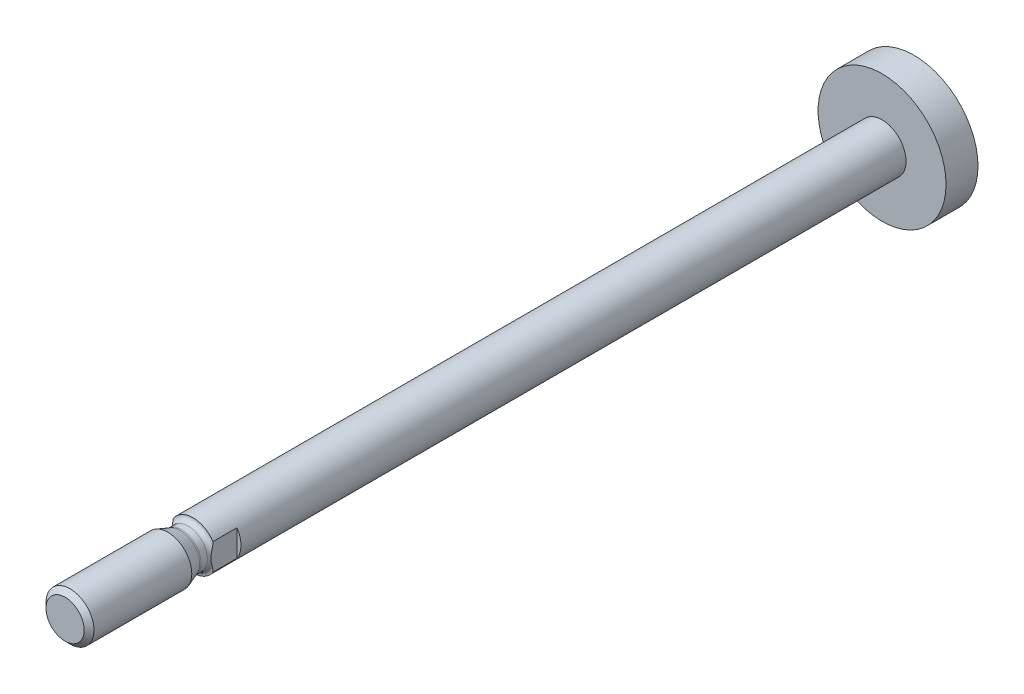
ISO-10303-21;
HEADER;
FILE_DESCRIPTION(('STEP AP214'),'2;1');
FILE_NAME('part.step','',(''),(''),'','','');
FILE_SCHEMA(('AUTOMOTIVE_DESIGN { 1 0 10303 214 1 1 1 1 }'));
ENDSEC;
DATA;
#1=APPLICATION_CONTEXT('core data for automotive mechanical design processes');
#2=APPLICATION_PROTOCOL_DEFINITION('international standard','automotive_design',2000,#1);
#3=PRODUCT_CONTEXT('',#1,'mechanical');
#4=PRODUCT('Part','Part','',(#3));
#5=PRODUCT_RELATED_PRODUCT_CATEGORY('part','',(#4));
#6=PRODUCT_DEFINITION_FORMATION('','',#4);
#7=PRODUCT_DEFINITION_CONTEXT('part definition',#1,'design');
#8=PRODUCT_DEFINITION('design','',#6,#7);
#9=PRODUCT_DEFINITION_SHAPE('','',#8);
#10=(LENGTH_UNIT() NAMED_UNIT(*) SI_UNIT(.MILLI.,.METRE.));
#11=(NAMED_UNIT(*) PLANE_ANGLE_UNIT() SI_UNIT($,.RADIAN.));
#12=(NAMED_UNIT(*) SI_UNIT($,.STERADIAN.) SOLID_ANGLE_UNIT());
#13=UNCERTAINTY_MEASURE_WITH_UNIT(LENGTH_MEASURE(1.E-05),#10,'distance_accuracy_value','');
#14=(GEOMETRIC_REPRESENTATION_CONTEXT(3) GLOBAL_UNCERTAINTY_ASSIGNED_CONTEXT((#13)) GLOBAL_UNIT_ASSIGNED_CONTEXT((#10,
#11,#12)) REPRESENTATION_CONTEXT('',''));
#15=CARTESIAN_POINT('',(0.,0.,0.));
#16=DIRECTION('',(0.,0.,1.));
#17=DIRECTION('',(1.,0.,0.));
#18=AXIS2_PLACEMENT_3D('',#15,#16,#17);
#19=CARTESIAN_POINT('',(0.,0.,-85.2));
#20=DIRECTION('',(0.,0.,1.));
#21=DIRECTION('',(1.,0.,0.));
#22=AXIS2_PLACEMENT_3D('',#19,#20,#21);
#23=CYLINDRICAL_SURFACE('',#22,3.);
#24=CARTESIAN_POINT('',(0.,0.,-81.2));
#25=DIRECTION('',(0.,0.,1.));
#26=DIRECTION('',(1.,0.,0.));
#27=AXIS2_PLACEMENT_3D('',#24,#25,#26);
#28=CIRCLE('',#27,3.);
#29=CARTESIAN_POINT('',(3.,0.,-81.2));
#30=VERTEX_POINT('',#29);
#31=EDGE_CURVE('E120',#30,#30,#28,.T.);
#32=ORIENTED_EDGE('',*,*,#31,.T.);
#33=EDGE_LOOP('',(#32));
#34=FACE_BOUND('',#33,.T.);
#35=DIRECTION('',(0.,0.,1.));
#36=VECTOR('',#35,1.);
#37=CARTESIAN_POINT('',(-2.5,-1.6583123951777,-85.2));
#38=LINE('',#37,#36);
#39=CARTESIAN_POINT('',(-2.5,-1.6583123951777,2.));
#40=VERTEX_POINT('',#39);
#41=CARTESIAN_POINT('',(-2.5,-1.6583123951777,5.));
#42=VERTEX_POINT('',#41);
#43=EDGE_CURVE('E50',#40,#42,#38,.T.);
#44=ORIENTED_EDGE('',*,*,#43,.F.);
#45=CARTESIAN_POINT('',(0.,0.,2.));
#46=DIRECTION('',(0.,0.,1.));
#47=DIRECTION('',(1.,0.,0.));
#48=AXIS2_PLACEMENT_3D('',#45,#46,#47);
#49=CIRCLE('',#48,3.);
#50=CARTESIAN_POINT('',(-2.5,1.6583123951777,2.));
#51=VERTEX_POINT('',#50);
#52=EDGE_CURVE('E11',#51,#40,#49,.T.);
#53=ORIENTED_EDGE('',*,*,#52,.F.);
#54=DIRECTION('',(0.,0.,1.));
#55=VECTOR('',#54,1.);
#56=CARTESIAN_POINT('',(-2.5,1.6583123951777,-85.2));
#57=LINE('',#56,#55);
#58=CARTESIAN_POINT('',(-2.5,1.65831239517778,4.99999999999909));
#59=VERTEX_POINT('',#58);
#60=EDGE_CURVE('E90',#59,#51,#57,.F.);
#61=ORIENTED_EDGE('',*,*,#60,.F.);
#62=CARTESIAN_POINT('',(0.,0.,5.));
#63=DIRECTION('',(0.,0.,1.));
#64=DIRECTION('',(1.,0.,0.));
#65=AXIS2_PLACEMENT_3D('',#62,#63,#64);
#66=CIRCLE('',#65,3.);
#67=CARTESIAN_POINT('',(2.5,1.6583123951777,5.));
#68=VERTEX_POINT('',#67);
#69=EDGE_CURVE('E89',#68,#59,#66,.T.);
#70=ORIENTED_EDGE('',*,*,#69,.F.);
#71=DIRECTION('',(0.,0.,1.));
#72=VECTOR('',#71,1.);
#73=CARTESIAN_POINT('',(2.5,1.6583123951777,-85.2));
#74=LINE('',#73,#72);
#75=CARTESIAN_POINT('',(2.5,1.6583123951777,2.));
#76=VERTEX_POINT('',#75);
#77=EDGE_CURVE('E58',#76,#68,#74,.T.);
#78=ORIENTED_EDGE('',*,*,#77,.F.);
#79=CARTESIAN_POINT('',(2.5,-1.6583123951777,2.));
#80=VERTEX_POINT('',#79);
#81=EDGE_CURVE('E39',#80,#76,#49,.T.);
#82=ORIENTED_EDGE('',*,*,#81,.F.);
#83=DIRECTION('',(0.,0.,1.));
#84=VECTOR('',#83,1.);
#85=CARTESIAN_POINT('',(2.5,-1.6583123951777,-85.2));
#86=LINE('',#85,#84);
#87=CARTESIAN_POINT('',(2.5,-1.65831239517778,4.99999999999909));
#88=VERTEX_POINT('',#87);
#89=EDGE_CURVE('E83',#88,#80,#86,.F.);
#90=ORIENTED_EDGE('',*,*,#89,.F.);
#91=EDGE_CURVE('E123',#42,#88,#66,.T.);
#92=ORIENTED_EDGE('',*,*,#91,.F.);
#93=EDGE_LOOP('',(#44,#53,#61,#70,#78,#82,#90,#92));
#94=FACE_BOUND('',#93,.T.);
#95=ADVANCED_FACE('F36',(#34,#94),#23,.T.);
#96=CARTESIAN_POINT('',(0.,0.,5.6000000000001));
#97=DIRECTION('',(0.,0.,1.));
#98=DIRECTION('',(1.,0.,0.));
#99=AXIS2_PLACEMENT_3D('',#96,#97,#98);
#100=TOROIDAL_SURFACE('',#99,3.0000000000001,0.600000000000099);
#101=CARTESIAN_POINT('',(0.,0.,5.6));
#102=DIRECTION('',(0.,0.,1.));
#103=DIRECTION('',(1.,0.,0.));
#104=AXIS2_PLACEMENT_3D('',#101,#102,#103);
#105=CIRCLE('',#104,2.4);
#106=CARTESIAN_POINT('',(2.4,0.,5.6));
#107=VERTEX_POINT('',#106);
#108=EDGE_CURVE('E111',#107,#107,#105,.T.);
#109=ORIENTED_EDGE('',*,*,#108,.F.);
#110=EDGE_LOOP('',(#109));
#111=FACE_BOUND('',#110,.T.);
#112=CARTESIAN_POINT('',(-2.5,0.,5.26833752096453));
#113=CARTESIAN_POINT('',(-2.5,0.0507234426297441,5.26834839993848));
#114=CARTESIAN_POINT('',(-2.5,0.101441776799662,5.26596843791489));
#115=CARTESIAN_POINT('',(-2.5,0.202536067556288,5.2569952015163));
#116=CARTESIAN_POINT('',(-2.5,0.252911588949165,5.2503973212644));
#117=CARTESIAN_POINT('',(-2.5,0.35392632203634,5.23403658213965));
#118=CARTESIAN_POINT('',(-2.5,0.404557369480025,5.224225913585));
#119=CARTESIAN_POINT('',(-2.5,0.505400398866161,5.20278595137819));
#120=CARTESIAN_POINT('',(-2.5,0.555612509775304,5.1911572409283));
#121=CARTESIAN_POINT('',(-2.5,0.655655613826413,5.16721678219831));
#122=CARTESIAN_POINT('',(-2.5,0.705487327239528,5.15490798008948));
#123=CARTESIAN_POINT('',(-2.5,0.805181864056362,5.13041893752706));
#124=CARTESIAN_POINT('',(-2.5,0.855044688832192,5.11823870324147));
#125=CARTESIAN_POINT('',(-2.5,1.00507376125951,5.08293674920261));
#126=CARTESIAN_POINT('',(-2.5,1.1055660279648,5.06108488117838));
#127=CARTESIAN_POINT('',(-2.5,1.30645493621981,5.02592717471424));
#128=CARTESIAN_POINT('',(-2.5,1.40682678389803,5.01248870030289));
#129=CARTESIAN_POINT('',(-2.5,1.60840199518987,4.99838763017595));
#130=CARTESIAN_POINT('',(-2.5,1.70960094347028,4.99767823287719));
#131=CARTESIAN_POINT('',(-2.5,1.86622781794818,5.01106448653587));
#132=CARTESIAN_POINT('',(-2.5,1.92218137883188,5.01877622049858));
#133=CARTESIAN_POINT('',(-2.5,2.03285053262341,5.0413651074687));
#134=CARTESIAN_POINT('',(-2.5,2.08756307823151,5.05625824117348));
#135=CARTESIAN_POINT('',(-2.5,2.18328084843635,5.09083457513036));
#136=CARTESIAN_POINT('',(-2.5,2.22483950461237,5.10896465354793));
#137=CARTESIAN_POINT('',(-2.5,2.30459524648064,5.1515245306446));
#138=CARTESIAN_POINT('',(-2.5,2.34279989724468,5.17593963670877));
#139=CARTESIAN_POINT('',(-2.5,2.40362753966407,5.22361594487622));
#140=CARTESIAN_POINT('',(-2.5,2.42757076392253,5.24518752529637));
#141=CARTESIAN_POINT('',(-2.5,2.47175757689057,5.29185573262645));
#142=CARTESIAN_POINT('',(-2.5,2.49200531158724,5.31694835263777));
#143=CARTESIAN_POINT('',(-2.5,2.52468492158815,5.36594738678137));
#144=CARTESIAN_POINT('',(-2.5,2.53785643218482,5.38935828111803));
#145=CARTESIAN_POINT('',(-2.5,2.56013164913301,5.43805384411947));
#146=CARTESIAN_POINT('',(-2.5,2.56923737677398,5.46333757440499));
#147=CARTESIAN_POINT('',(-2.5,2.58283057049981,5.51527496834575));
#148=CARTESIAN_POINT('',(-2.5,2.58729356105886,5.54193512227162));
#149=CARTESIAN_POINT('',(-2.5,2.59118020467599,5.59561989324821));
#150=CARTESIAN_POINT('',(-2.5,2.5906054179438,5.62264439487102));
#151=CARTESIAN_POINT('',(-2.5,2.5847447911938,5.67371298536964));
#152=CARTESIAN_POINT('',(-2.5,2.57988467167735,5.69780754958458));
#153=CARTESIAN_POINT('',(-2.5,2.56633022368149,5.74488485425705));
#154=CARTESIAN_POINT('',(-2.5,2.55763543991684,5.76786746233366));
#155=CARTESIAN_POINT('',(-2.5,2.53647695281551,5.81308697753744));
#156=CARTESIAN_POINT('',(-2.5,2.52388217742275,5.83526203314746));
#157=CARTESIAN_POINT('',(-2.5,2.49565831542702,5.87756858678122));
#158=CARTESIAN_POINT('',(-2.5,2.4800283022487,5.897699457906));
#159=CARTESIAN_POINT('',(-2.5,2.4381803160609,5.94494905141413));
#160=CARTESIAN_POINT('',(-2.5,2.41048793322772,5.97076525046522));
#161=CARTESIAN_POINT('',(-2.5,2.35128940318857,6.01762864695372));
#162=CARTESIAN_POINT('',(-2.5,2.31977194494069,6.03866114436212));
#163=CARTESIAN_POINT('',(-2.5,2.23952256294481,6.08463351159361));
#164=CARTESIAN_POINT('',(-2.5,2.18939204577726,6.10711912432076));
#165=CARTESIAN_POINT('',(-2.5,2.086424206848,6.14398267826286));
#166=CARTESIAN_POINT('',(-2.5,2.03358928965091,6.15836768991921));
#167=CARTESIAN_POINT('',(-2.5,1.93599580204544,6.17849484994285));
#168=CARTESIAN_POINT('',(-2.5,1.89144834077192,6.18531116329585));
#169=CARTESIAN_POINT('',(-2.5,1.80189908033616,6.19505697557448));
#170=CARTESIAN_POINT('',(-2.5,1.75689686177072,6.19798247787778));
#171=CARTESIAN_POINT('',(-2.5,1.66646832286127,6.20053377831371));
#172=CARTESIAN_POINT('',(-2.5,1.6210413945456,6.20013412759755));
#173=CARTESIAN_POINT('',(-2.5,1.53034280767568,6.19650595241103));
#174=CARTESIAN_POINT('',(-2.5,1.48507106445849,6.1932793543307));
#175=CARTESIAN_POINT('',(-2.5,1.33918047559004,6.17906735223514));
#176=CARTESIAN_POINT('',(-2.5,1.23902345631669,6.16342028964884));
#177=CARTESIAN_POINT('',(-2.5,1.03994836030368,6.12508984420092));
#178=CARTESIAN_POINT('',(-2.5,0.941034235224376,6.10238806221333));
#179=CARTESIAN_POINT('',(-2.5,0.793509038998567,6.06677672186832));
#180=CARTESIAN_POINT('',(-2.5,0.7446863854637,6.054702575567));
#181=CARTESIAN_POINT('',(-2.5,0.646996290398524,6.030738686552));
#182=CARTESIAN_POINT('',(-2.5,0.598128851070118,6.0188489352388));
#183=CARTESIAN_POINT('',(-2.5,0.500334281886721,5.99617397742217));
#184=CARTESIAN_POINT('',(-2.5,0.451408146263369,5.98538460255591));
#185=CARTESIAN_POINT('',(-2.5,0.353119090508098,5.96594052833405));
#186=CARTESIAN_POINT('',(-2.5,0.303756196305667,5.95728570312374));
#187=CARTESIAN_POINT('',(-2.5,0.204122497966492,5.94328110899502));
#188=CARTESIAN_POINT('',(-2.5,0.153847567097064,5.93795905985694));
#189=CARTESIAN_POINT('',(-2.5,0.0530351286873156,5.93177082830429));
#190=CARTESIAN_POINT('',(-2.5,0.0024977994589948,5.930901937583));
#191=CARTESIAN_POINT('',(-2.5,-0.0985305210715612,5.93381110626722));
#192=CARTESIAN_POINT('',(-2.5,-0.14902123482016,5.93759813511376));
#193=CARTESIAN_POINT('',(-2.5,-0.249573888409545,5.94904126176878));
#194=CARTESIAN_POINT('',(-2.5,-0.299635458091892,5.95670041313862));
#195=CARTESIAN_POINT('',(-2.5,-0.399725252919972,5.97472154484855));
#196=CARTESIAN_POINT('',(-2.5,-0.449748880216866,5.98510788708088));
#197=CARTESIAN_POINT('',(-2.5,-0.549453617514231,6.00732659888942));
#198=CARTESIAN_POINT('',(-2.5,-0.599134785603654,6.01915871651809));
#199=CARTESIAN_POINT('',(-2.5,-0.698392421521691,6.04328051823731));
#200=CARTESIAN_POINT('',(-2.5,-0.747968869022546,6.05557028383309));
#201=CARTESIAN_POINT('',(-2.5,-0.84720464589227,6.07981009984425));
#202=CARTESIAN_POINT('',(-2.5,-0.896863971124109,6.0917601667094));
#203=CARTESIAN_POINT('',(-2.5,-0.975241469303783,6.10978478042876));
#204=CARTESIAN_POINT('',(-2.5,-1.00388150216564,6.11619624816889));
#205=CARTESIAN_POINT('',(-2.5,-1.06125902675178,6.12857195456169));
#206=CARTESIAN_POINT('',(-2.5,-1.08999652018277,6.13453618533974));
#207=CARTESIAN_POINT('',(-2.5,-1.14748265723325,6.1458846074232));
#208=CARTESIAN_POINT('',(-2.5,-1.17623091126653,6.15127075206469));
#209=CARTESIAN_POINT('',(-2.5,-1.23384312688132,6.16137594760793));
#210=CARTESIAN_POINT('',(-2.5,-1.26270708577413,6.16609501391968));
#211=CARTESIAN_POINT('',(-2.5,-1.34949136584038,6.17908804539659));
#212=CARTESIAN_POINT('',(-2.5,-1.40759592627029,6.18619616796949));
#213=CARTESIAN_POINT('',(-2.5,-1.52420669712544,6.19636423685649));
#214=CARTESIAN_POINT('',(-2.5,-1.58271310503325,6.1994220245478));
#215=CARTESIAN_POINT('',(-2.5,-1.70911532678372,6.20051114496721));
#216=CARTESIAN_POINT('',(-2.5,-1.77702602049488,6.19766666103081));
#217=CARTESIAN_POINT('',(-2.5,-1.912149147007,6.18315262249392));
#218=CARTESIAN_POINT('',(-2.5,-1.97936016975703,6.17146782027944));
#219=CARTESIAN_POINT('',(-2.5,-2.09293467910467,6.14162835403314));
#220=CARTESIAN_POINT('',(-2.5,-2.1399801193776,6.12611102431254));
#221=CARTESIAN_POINT('',(-2.5,-2.23116163556241,6.08815370009842));
#222=CARTESIAN_POINT('',(-2.5,-2.27530548479003,6.06573319994486));
#223=CARTESIAN_POINT('',(-2.5,-2.34660579555824,6.0206656653127));
#224=CARTESIAN_POINT('',(-2.5,-2.37498330055351,5.99995880382842));
#225=CARTESIAN_POINT('',(-2.5,-2.42818185419372,5.95435228802646));
#226=CARTESIAN_POINT('',(-2.5,-2.45300628498281,5.92945667074117));
#227=CARTESIAN_POINT('',(-2.5,-2.49337206402375,5.88080957286876));
#228=CARTESIAN_POINT('',(-2.5,-2.50977972671913,5.85778028891266));
#229=CARTESIAN_POINT('',(-2.5,-2.5385948801776,5.80932543735906));
#230=CARTESIAN_POINT('',(-2.5,-2.55100468980703,5.7839012699618));
#231=CARTESIAN_POINT('',(-2.5,-2.57111606880391,5.7310152189761));
#232=CARTESIAN_POINT('',(-2.5,-2.57878240755407,5.70353974708557));
#233=CARTESIAN_POINT('',(-2.5,-2.58865812747843,5.64762323062993));
#234=CARTESIAN_POINT('',(-2.5,-2.59087093912576,5.61918280447873));
#235=CARTESIAN_POINT('',(-2.5,-2.58974032110845,5.56589468768046));
#236=CARTESIAN_POINT('',(-2.5,-2.58704036062141,5.54103102121321));
#237=CARTESIAN_POINT('',(-2.5,-2.57748265423562,5.49212434637714));
#238=CARTESIAN_POINT('',(-2.5,-2.57062518368025,5.46808128377277));
#239=CARTESIAN_POINT('',(-2.5,-2.55318309970271,5.42147694109437));
#240=CARTESIAN_POINT('',(-2.5,-2.54260847384664,5.39891188066154));
#241=CARTESIAN_POINT('',(-2.5,-2.51826231502416,5.35558968714916));
#242=CARTESIAN_POINT('',(-2.5,-2.50448933519591,5.33483337816906));
#243=CARTESIAN_POINT('',(-2.5,-2.46797257111134,5.28708275256527));
#244=CARTESIAN_POINT('',(-2.5,-2.44388663659998,5.26111270404154));
#245=CARTESIAN_POINT('',(-2.5,-2.39183121173732,5.21341702762138));
#246=CARTESIAN_POINT('',(-2.5,-2.36385414462067,5.19169988455002));
#247=CARTESIAN_POINT('',(-2.5,-2.29309604385226,5.14424955817408));
#248=CARTESIAN_POINT('',(-2.5,-2.24896151787955,5.12054273771195));
#249=CARTESIAN_POINT('',(-2.5,-2.15755724893995,5.08032986787273));
#250=CARTESIAN_POINT('',(-2.5,-2.1102815253453,5.0638380357592));
#251=CARTESIAN_POINT('',(-2.5,-1.98539576167196,5.02901994971649));
#252=CARTESIAN_POINT('',(-2.5,-1.90647682078743,5.01544295171964));
#253=CARTESIAN_POINT('',(-2.5,-1.74768813149434,5.00017484346382));
#254=CARTESIAN_POINT('',(-2.5,-1.66781762927049,4.99849388464395));
#255=CARTESIAN_POINT('',(-2.5,-1.45429321635247,5.00579419289827));
#256=CARTESIAN_POINT('',(-2.5,-1.32097329964418,5.02279704607492));
#257=CARTESIAN_POINT('',(-2.5,-1.12273292987174,5.05843900515103));
#258=CARTESIAN_POINT('',(-2.5,-1.05669317759064,5.07208123732001));
#259=CARTESIAN_POINT('',(-2.5,-0.925080173294097,5.10144856377507));
#260=CARTESIAN_POINT('',(-2.5,-0.85950678696237,5.11717303045709));
#261=CARTESIAN_POINT('',(-2.5,-0.728157455724953,5.14928145287764));
#262=CARTESIAN_POINT('',(-2.5,-0.662382356378558,5.16566853749943));
#263=CARTESIAN_POINT('',(-2.5,-0.530451230737349,5.19710748690057));
#264=CARTESIAN_POINT('',(-2.5,-0.46429498692756,5.21215848739435));
#265=CARTESIAN_POINT('',(-2.5,-0.332137198799993,5.23811298682939));
#266=CARTESIAN_POINT('',(-2.5,-0.266147995614798,5.24907485812429));
#267=CARTESIAN_POINT('',(-2.5,-0.13343508853748,5.26417313941374));
#268=CARTESIAN_POINT('',(-2.5,-0.0667131258677896,5.26832321258322));
#269=CARTESIAN_POINT('',(-2.5,0.,5.26833752096453));
#270=B_SPLINE_CURVE_WITH_KNOTS('',3,(#112,#113,#114,#115,#116,#117,#118,#119,#120,#121,#122,
#123,#124,#125,#126,#127,#128,#129,#130,#131,#132,#133,#134,#135,#136,#137,#138,#139,#140,#141,
#142,#143,#144,#145,#146,#147,#148,#149,#150,#151,#152,#153,#154,#155,#156,#157,#158,#159,#160,
#161,#162,#163,#164,#165,#166,#167,#168,#169,#170,#171,#172,#173,#174,#175,#176,#177,#178,#179,
#180,#181,#182,#183,#184,#185,#186,#187,#188,#189,#190,#191,#192,#193,#194,#195,#196,#197,#198,
#199,#200,#201,#202,#203,#204,#205,#206,#207,#208,#209,#210,#211,#212,#213,#214,#215,#216,#217,
#218,#219,#220,#221,#222,#223,#224,#225,#226,#227,#228,#229,#230,#231,#232,#233,#234,#235,#236,
#237,#238,#239,#240,#241,#242,#243,#244,#245,#246,#247,#248,#249,#250,#251,#252,#253,#254,#255,
#256,#257,#258,#259,#260,#261,#262,#263,#264,#265,#266,#267,#268,#269),.UNSPECIFIED.,.T.,.F.,(4,
2,2,2,2,2,2,2,2,2,2,2,2,2,2,2,2,2,2,2,2,2,2,2,2,2,2,2,2,2,2,2,2,2,2,2,2,2,2,2,2,2,2,2,2,2,2,2,2,
2,2,2,2,2,2,2,2,2,2,2,2,2,2,2,2,2,2,2,2,2,2,2,2,2,2,2,2,2,4),(0.,0.152115749462961,
0.304397890479205,0.459057777660119,0.613668153537359,0.76765452052503,0.921648241698668,
1.22999186740174,1.53334327295527,1.83557910296654,2.00468122496769,2.17416139710525,
2.30975526259906,2.44503498191611,2.54138706790922,2.63763038250484,2.71788414225495,
2.79809795959123,2.87873253660465,2.95934214181033,3.03274594433316,3.10615846435156,
3.18237030946167,3.25860545664829,3.37154774885102,3.48483255287211,3.64874326809032,
3.81251069461259,3.94751849926572,4.08266487644991,4.21884653384819,4.35493546397263,
4.65852821936571,4.96291950372185,5.11380283698696,5.2646791123006,5.41496078164642,
5.56523358814694,5.71674021710462,5.86815469233289,6.01986131905259,6.17168776888823,
6.3249195654772,6.47812469716163,6.63135724578266,6.7845823615018,6.87262624262423,
6.9606716735928,7.04840955727845,7.13614541382411,7.31164210225534,7.487232283928,
7.69072100095721,7.89456149389004,8.04275027379228,8.1905243529531,8.29556794817655,
8.40051087855684,8.48500651711341,8.56945305722983,8.65451949621374,8.73953241154295,
8.81419843639983,8.88885951681877,8.96332150589878,9.03781724571823,9.14348655987521,
9.24936459025057,9.39882327642183,9.54857516145059,9.78744806917548,10.0265247936209,
10.4280628477144,10.630387719692,10.8326517473681,11.0360188284461,11.239516519211,
11.439986712254,11.6400543065313),.UNSPECIFIED.);
#271=EDGE_CURVE('E81',#42,#59,#270,.T.);
#272=ORIENTED_EDGE('',*,*,#271,.F.);
#273=ORIENTED_EDGE('',*,*,#91,.T.);
#274=CARTESIAN_POINT('',(2.5,0.,5.26833752096453));
#275=CARTESIAN_POINT('',(2.5,-0.0507234426297441,5.26834839993848));
#276=CARTESIAN_POINT('',(2.5,-0.101441776799662,5.26596843791489));
#277=CARTESIAN_POINT('',(2.5,-0.202536067556288,5.2569952015163));
#278=CARTESIAN_POINT('',(2.5,-0.252911588949165,5.2503973212644));
#279=CARTESIAN_POINT('',(2.5,-0.35392632203634,5.23403658213965));
#280=CARTESIAN_POINT('',(2.5,-0.404557369480025,5.224225913585));
#281=CARTESIAN_POINT('',(2.5,-0.505400398866161,5.20278595137819));
#282=CARTESIAN_POINT('',(2.5,-0.555612509775304,5.1911572409283));
#283=CARTESIAN_POINT('',(2.5,-0.655655613826413,5.16721678219831));
#284=CARTESIAN_POINT('',(2.5,-0.705487327239528,5.15490798008948));
#285=CARTESIAN_POINT('',(2.5,-0.805181864056362,5.13041893752706));
#286=CARTESIAN_POINT('',(2.5,-0.855044688832192,5.11823870324147));
#287=CARTESIAN_POINT('',(2.5,-1.00507376125951,5.08293674920261));
#288=CARTESIAN_POINT('',(2.5,-1.1055660279648,5.06108488117838));
#289=CARTESIAN_POINT('',(2.5,-1.30645493621981,5.02592717471424));
#290=CARTESIAN_POINT('',(2.5,-1.40682678389803,5.01248870030289));
#291=CARTESIAN_POINT('',(2.5,-1.60840199518987,4.99838763017595));
#292=CARTESIAN_POINT('',(2.5,-1.70960094347028,4.99767823287719));
#293=CARTESIAN_POINT('',(2.5,-1.86622781794818,5.01106448653587));
#294=CARTESIAN_POINT('',(2.5,-1.92218137883188,5.01877622049858));
#295=CARTESIAN_POINT('',(2.5,-2.03285053262341,5.0413651074687));
#296=CARTESIAN_POINT('',(2.5,-2.08756307823151,5.05625824117348));
#297=CARTESIAN_POINT('',(2.5,-2.18328084843635,5.09083457513036));
#298=CARTESIAN_POINT('',(2.5,-2.22483950461237,5.10896465354793));
#299=CARTESIAN_POINT('',(2.5,-2.30459524648064,5.1515245306446));
#300=CARTESIAN_POINT('',(2.5,-2.34279989724468,5.17593963670877));
#301=CARTESIAN_POINT('',(2.5,-2.40362753966407,5.22361594487622));
#302=CARTESIAN_POINT('',(2.5,-2.42757076392253,5.24518752529637));
#303=CARTESIAN_POINT('',(2.5,-2.47175757689057,5.29185573262645));
#304=CARTESIAN_POINT('',(2.5,-2.49200531158724,5.31694835263777));
#305=CARTESIAN_POINT('',(2.5,-2.52468492158815,5.36594738678137));
#306=CARTESIAN_POINT('',(2.5,-2.53785643218482,5.38935828111803));
#307=CARTESIAN_POINT('',(2.5,-2.56013164913301,5.43805384411947));
#308=CARTESIAN_POINT('',(2.5,-2.56923737677398,5.46333757440499));
#309=CARTESIAN_POINT('',(2.5,-2.58283057049981,5.51527496834575));
#310=CARTESIAN_POINT('',(2.5,-2.58729356105886,5.54193512227162));
#311=CARTESIAN_POINT('',(2.5,-2.59118020467599,5.59561989324821));
#312=CARTESIAN_POINT('',(2.5,-2.5906054179438,5.62264439487102));
#313=CARTESIAN_POINT('',(2.5,-2.5847447911938,5.67371298536964));
#314=CARTESIAN_POINT('',(2.5,-2.57988467167735,5.69780754958458));
#315=CARTESIAN_POINT('',(2.5,-2.56633022368149,5.74488485425705));
#316=CARTESIAN_POINT('',(2.5,-2.55763543991684,5.76786746233366));
#317=CARTESIAN_POINT('',(2.5,-2.53647695281551,5.81308697753744));
#318=CARTESIAN_POINT('',(2.5,-2.52388217742275,5.83526203314746));
#319=CARTESIAN_POINT('',(2.5,-2.49565831542702,5.87756858678122));
#320=CARTESIAN_POINT('',(2.5,-2.4800283022487,5.897699457906));
#321=CARTESIAN_POINT('',(2.5,-2.4381803160609,5.94494905141413));
#322=CARTESIAN_POINT('',(2.5,-2.41048793322772,5.97076525046522));
#323=CARTESIAN_POINT('',(2.5,-2.35128940318857,6.01762864695372));
#324=CARTESIAN_POINT('',(2.5,-2.31977194494069,6.03866114436212));
#325=CARTESIAN_POINT('',(2.5,-2.23952256294481,6.08463351159361));
#326=CARTESIAN_POINT('',(2.5,-2.18939204577726,6.10711912432076));
#327=CARTESIAN_POINT('',(2.5,-2.086424206848,6.14398267826286));
#328=CARTESIAN_POINT('',(2.5,-2.03358928965091,6.15836768991921));
#329=CARTESIAN_POINT('',(2.5,-1.93599580204544,6.17849484994285));
#330=CARTESIAN_POINT('',(2.5,-1.89144834077192,6.18531116329585));
#331=CARTESIAN_POINT('',(2.5,-1.80189908033616,6.19505697557448));
#332=CARTESIAN_POINT('',(2.5,-1.75689686177072,6.19798247787778));
#333=CARTESIAN_POINT('',(2.5,-1.66646832286127,6.20053377831371));
#334=CARTESIAN_POINT('',(2.5,-1.6210413945456,6.20013412759755));
#335=CARTESIAN_POINT('',(2.5,-1.53034280767568,6.19650595241103));
#336=CARTESIAN_POINT('',(2.5,-1.48507106445849,6.1932793543307));
#337=CARTESIAN_POINT('',(2.5,-1.33918047559004,6.17906735223514));
#338=CARTESIAN_POINT('',(2.5,-1.23902345631669,6.16342028964884));
#339=CARTESIAN_POINT('',(2.5,-1.03994836030368,6.12508984420092));
#340=CARTESIAN_POINT('',(2.5,-0.941034235224376,6.10238806221333));
#341=CARTESIAN_POINT('',(2.5,-0.793509038998567,6.06677672186832));
#342=CARTESIAN_POINT('',(2.5,-0.7446863854637,6.054702575567));
#343=CARTESIAN_POINT('',(2.5,-0.646996290398524,6.030738686552));
#344=CARTESIAN_POINT('',(2.5,-0.598128851070118,6.0188489352388));
#345=CARTESIAN_POINT('',(2.5,-0.500334281886721,5.99617397742217));
#346=CARTESIAN_POINT('',(2.5,-0.451408146263369,5.98538460255591));
#347=CARTESIAN_POINT('',(2.5,-0.353119090508098,5.96594052833405));
#348=CARTESIAN_POINT('',(2.5,-0.303756196305667,5.95728570312374));
#349=CARTESIAN_POINT('',(2.5,-0.204122497966492,5.94328110899502));
#350=CARTESIAN_POINT('',(2.5,-0.153847567097064,5.93795905985694));
#351=CARTESIAN_POINT('',(2.5,-0.0530351286873156,5.93177082830429));
#352=CARTESIAN_POINT('',(2.5,-0.0024977994589948,5.930901937583));
#353=CARTESIAN_POINT('',(2.5,0.0985305210715612,5.93381110626722));
#354=CARTESIAN_POINT('',(2.5,0.14902123482016,5.93759813511376));
#355=CARTESIAN_POINT('',(2.5,0.249573888409545,5.94904126176878));
#356=CARTESIAN_POINT('',(2.5,0.299635458091892,5.95670041313862));
#357=CARTESIAN_POINT('',(2.5,0.399725252919972,5.97472154484855));
#358=CARTESIAN_POINT('',(2.5,0.449748880216866,5.98510788708088));
#359=CARTESIAN_POINT('',(2.5,0.549453617514231,6.00732659888942));
#360=CARTESIAN_POINT('',(2.5,0.599134785603654,6.01915871651809));
#361=CARTESIAN_POINT('',(2.5,0.698392421521691,6.04328051823731));
#362=CARTESIAN_POINT('',(2.5,0.747968869022546,6.05557028383309));
#363=CARTESIAN_POINT('',(2.5,0.84720464589227,6.07981009984425));
#364=CARTESIAN_POINT('',(2.5,0.896863971124109,6.0917601667094));
#365=CARTESIAN_POINT('',(2.5,0.975241469303783,6.10978478042876));
#366=CARTESIAN_POINT('',(2.5,1.00388150216564,6.11619624816889));
#367=CARTESIAN_POINT('',(2.5,1.06125902675178,6.12857195456169));
#368=CARTESIAN_POINT('',(2.5,1.08999652018277,6.13453618533974));
#369=CARTESIAN_POINT('',(2.5,1.14748265723325,6.1458846074232));
#370=CARTESIAN_POINT('',(2.5,1.17623091126653,6.15127075206469));
#371=CARTESIAN_POINT('',(2.5,1.23384312688132,6.16137594760793));
#372=CARTESIAN_POINT('',(2.5,1.26270708577413,6.16609501391968));
#373=CARTESIAN_POINT('',(2.5,1.34949136584038,6.17908804539659));
#374=CARTESIAN_POINT('',(2.5,1.40759592627029,6.18619616796949));
#375=CARTESIAN_POINT('',(2.5,1.52420669712544,6.19636423685649));
#376=CARTESIAN_POINT('',(2.5,1.58271310503325,6.1994220245478));
#377=CARTESIAN_POINT('',(2.5,1.70911532678372,6.20051114496721));
#378=CARTESIAN_POINT('',(2.5,1.77702602049488,6.19766666103081));
#379=CARTESIAN_POINT('',(2.5,1.912149147007,6.18315262249392));
#380=CARTESIAN_POINT('',(2.5,1.97936016975703,6.17146782027944));
#381=CARTESIAN_POINT('',(2.5,2.09293467910467,6.14162835403314));
#382=CARTESIAN_POINT('',(2.5,2.1399801193776,6.12611102431254));
#383=CARTESIAN_POINT('',(2.5,2.23116163556241,6.08815370009842));
#384=CARTESIAN_POINT('',(2.5,2.27530548479003,6.06573319994486));
#385=CARTESIAN_POINT('',(2.5,2.34660579555824,6.0206656653127));
#386=CARTESIAN_POINT('',(2.5,2.37498330055351,5.99995880382842));
#387=CARTESIAN_POINT('',(2.5,2.42818185419372,5.95435228802646));
#388=CARTESIAN_POINT('',(2.5,2.45300628498281,5.92945667074117));
#389=CARTESIAN_POINT('',(2.5,2.49337206402375,5.88080957286876));
#390=CARTESIAN_POINT('',(2.5,2.50977972671913,5.85778028891266));
#391=CARTESIAN_POINT('',(2.5,2.5385948801776,5.80932543735906));
#392=CARTESIAN_POINT('',(2.5,2.55100468980703,5.7839012699618));
#393=CARTESIAN_POINT('',(2.5,2.57111606880391,5.7310152189761));
#394=CARTESIAN_POINT('',(2.5,2.57878240755407,5.70353974708557));
#395=CARTESIAN_POINT('',(2.5,2.58865812747843,5.64762323062993));
#396=CARTESIAN_POINT('',(2.5,2.59087093912576,5.61918280447873));
#397=CARTESIAN_POINT('',(2.5,2.58974032110845,5.56589468768046));
#398=CARTESIAN_POINT('',(2.5,2.58704036062141,5.54103102121321));
#399=CARTESIAN_POINT('',(2.5,2.57748265423562,5.49212434637714));
#400=CARTESIAN_POINT('',(2.5,2.57062518368025,5.46808128377277));
#401=CARTESIAN_POINT('',(2.5,2.55318309970271,5.42147694109437));
#402=CARTESIAN_POINT('',(2.5,2.54260847384664,5.39891188066154));
#403=CARTESIAN_POINT('',(2.5,2.51826231502416,5.35558968714916));
#404=CARTESIAN_POINT('',(2.5,2.50448933519591,5.33483337816906));
#405=CARTESIAN_POINT('',(2.5,2.46797257111134,5.28708275256527));
#406=CARTESIAN_POINT('',(2.5,2.44388663659998,5.26111270404154));
#407=CARTESIAN_POINT('',(2.5,2.39183121173732,5.21341702762138));
#408=CARTESIAN_POINT('',(2.5,2.36385414462067,5.19169988455002));
#409=CARTESIAN_POINT('',(2.5,2.29309604385226,5.14424955817408));
#410=CARTESIAN_POINT('',(2.5,2.24896151787955,5.12054273771195));
#411=CARTESIAN_POINT('',(2.5,2.15755724893995,5.08032986787273));
#412=CARTESIAN_POINT('',(2.5,2.1102815253453,5.0638380357592));
#413=CARTESIAN_POINT('',(2.5,1.98539576167196,5.02901994971649));
#414=CARTESIAN_POINT('',(2.5,1.90647682078743,5.01544295171964));
#415=CARTESIAN_POINT('',(2.5,1.74768813149434,5.00017484346382));
#416=CARTESIAN_POINT('',(2.5,1.66781762927049,4.99849388464395));
#417=CARTESIAN_POINT('',(2.5,1.45429321635247,5.00579419289827));
#418=CARTESIAN_POINT('',(2.5,1.32097329964418,5.02279704607492));
#419=CARTESIAN_POINT('',(2.5,1.12273292987174,5.05843900515103));
#420=CARTESIAN_POINT('',(2.5,1.05669317759064,5.07208123732001));
#421=CARTESIAN_POINT('',(2.5,0.925080173294097,5.10144856377507));
#422=CARTESIAN_POINT('',(2.5,0.85950678696237,5.11717303045709));
#423=CARTESIAN_POINT('',(2.5,0.728157455724953,5.14928145287764));
#424=CARTESIAN_POINT('',(2.5,0.662382356378558,5.16566853749943));
#425=CARTESIAN_POINT('',(2.5,0.530451230737349,5.19710748690057));
#426=CARTESIAN_POINT('',(2.5,0.46429498692756,5.21215848739435));
#427=CARTESIAN_POINT('',(2.5,0.332137198799993,5.23811298682939));
#428=CARTESIAN_POINT('',(2.5,0.266147995614798,5.24907485812429));
#429=CARTESIAN_POINT('',(2.5,0.13343508853748,5.26417313941374));
#430=CARTESIAN_POINT('',(2.5,0.0667131258677896,5.26832321258322));
#431=CARTESIAN_POINT('',(2.5,0.,5.26833752096453));
#432=B_SPLINE_CURVE_WITH_KNOTS('',3,(#274,#275,#276,#277,#278,#279,#280,#281,#282,#283,#284,
#285,#286,#287,#288,#289,#290,#291,#292,#293,#294,#295,#296,#297,#298,#299,#300,#301,#302,#303,
#304,#305,#306,#307,#308,#309,#310,#311,#312,#313,#314,#315,#316,#317,#318,#319,#320,#321,#322,
#323,#324,#325,#326,#327,#328,#329,#330,#331,#332,#333,#334,#335,#336,#337,#338,#339,#340,#341,
#342,#343,#344,#345,#346,#347,#348,#349,#350,#351,#352,#353,#354,#355,#356,#357,#358,#359,#360,
#361,#362,#363,#364,#365,#366,#367,#368,#369,#370,#371,#372,#373,#374,#375,#376,#377,#378,#379,
#380,#381,#382,#383,#384,#385,#386,#387,#388,#389,#390,#391,#392,#393,#394,#395,#396,#397,#398,
#399,#400,#401,#402,#403,#404,#405,#406,#407,#408,#409,#410,#411,#412,#413,#414,#415,#416,#417,
#418,#419,#420,#421,#422,#423,#424,#425,#426,#427,#428,#429,#430,#431),.UNSPECIFIED.,.T.,.F.,(4,
2,2,2,2,2,2,2,2,2,2,2,2,2,2,2,2,2,2,2,2,2,2,2,2,2,2,2,2,2,2,2,2,2,2,2,2,2,2,2,2,2,2,2,2,2,2,2,2,
2,2,2,2,2,2,2,2,2,2,2,2,2,2,2,2,2,2,2,2,2,2,2,2,2,2,2,2,2,4),(0.,0.152115749462961,
0.304397890479205,0.459057777660119,0.613668153537359,0.76765452052503,0.921648241698668,
1.22999186740174,1.53334327295527,1.83557910296654,2.00468122496769,2.17416139710525,
2.30975526259906,2.44503498191611,2.54138706790922,2.63763038250484,2.71788414225495,
2.79809795959123,2.87873253660465,2.95934214181033,3.03274594433316,3.10615846435156,
3.18237030946167,3.25860545664829,3.37154774885102,3.48483255287211,3.64874326809032,
3.81251069461259,3.94751849926572,4.08266487644991,4.21884653384819,4.35493546397263,
4.65852821936571,4.96291950372185,5.11380283698696,5.2646791123006,5.41496078164642,
5.56523358814694,5.71674021710462,5.86815469233289,6.01986131905259,6.17168776888823,
6.3249195654772,6.47812469716163,6.63135724578266,6.7845823615018,6.87262624262423,
6.9606716735928,7.04840955727845,7.13614541382411,7.31164210225534,7.487232283928,
7.69072100095721,7.89456149389004,8.04275027379228,8.1905243529531,8.29556794817655,
8.40051087855684,8.48500651711341,8.56945305722983,8.65451949621374,8.73953241154295,
8.81419843639983,8.88885951681877,8.96332150589878,9.03781724571823,9.14348655987521,
9.24936459025057,9.39882327642183,9.54857516145059,9.78744806917548,10.0265247936209,
10.4280628477144,10.630387719692,10.8326517473681,11.0360188284461,11.239516519211,
11.439986712254,11.6400543065313),.UNSPECIFIED.);
#433=EDGE_CURVE('E125',#68,#88,#432,.T.);
#434=ORIENTED_EDGE('',*,*,#433,.F.);
#435=ORIENTED_EDGE('',*,*,#69,.T.);
#436=EDGE_LOOP('',(#272,#273,#434,#435));
#437=FACE_BOUND('',#436,.T.);
#438=ADVANCED_FACE('F135',(#111,#437),#100,.F.);
#439=CARTESIAN_POINT('',(0.,3.,-81.2));
#440=DIRECTION('',(0.,0.,-1.));
#441=DIRECTION('',(-1.,0.,0.));
#442=AXIS2_PLACEMENT_3D('',#439,#440,#441);
#443=PLANE('',#442);
#444=ORIENTED_EDGE('',*,*,#31,.F.);
#445=EDGE_LOOP('',(#444));
#446=FACE_BOUND('',#445,.T.);
#447=CARTESIAN_POINT('',(0.,0.,-81.2));
#448=DIRECTION('',(0.,0.,1.));
#449=DIRECTION('',(1.,0.,0.));
#450=AXIS2_PLACEMENT_3D('',#447,#448,#449);
#451=CIRCLE('',#450,8.);
#452=CARTESIAN_POINT('',(8.,0.,-81.2));
#453=VERTEX_POINT('',#452);
#454=EDGE_CURVE('E117',#453,#453,#451,.T.);
#455=ORIENTED_EDGE('',*,*,#454,.T.);
#456=EDGE_LOOP('',(#455));
#457=FACE_BOUND('',#456,.T.);
#458=ADVANCED_FACE('F182',(#446,#457),#443,.F.);
#459=CARTESIAN_POINT('',(0.,0.,-85.2));
#460=DIRECTION('',(0.,0.,1.));
#461=DIRECTION('',(1.,0.,0.));
#462=AXIS2_PLACEMENT_3D('',#459,#460,#461);
#463=CYLINDRICAL_SURFACE('',#462,8.);
#464=ORIENTED_EDGE('',*,*,#454,.F.);
#465=EDGE_LOOP('',(#464));
#466=FACE_BOUND('',#465,.T.);
#467=CARTESIAN_POINT('',(0.,0.,-85.2));
#468=DIRECTION('',(0.,0.,1.));
#469=DIRECTION('',(1.,0.,0.));
#470=AXIS2_PLACEMENT_3D('',#467,#468,#469);
#471=CIRCLE('',#470,8.);
#472=CARTESIAN_POINT('',(8.,0.,-85.2));
#473=VERTEX_POINT('',#472);
#474=EDGE_CURVE('E114',#473,#473,#471,.T.);
#475=ORIENTED_EDGE('',*,*,#474,.T.);
#476=EDGE_LOOP('',(#475));
#477=FACE_BOUND('',#476,.T.);
#478=ADVANCED_FACE('F173',(#466,#477),#463,.T.);
#479=CARTESIAN_POINT('',(0.,8.,-85.2));
#480=DIRECTION('',(0.,0.,1.));
#481=DIRECTION('',(1.,0.,0.));
#482=AXIS2_PLACEMENT_3D('',#479,#480,#481);
#483=PLANE('',#482);
#484=ORIENTED_EDGE('',*,*,#474,.F.);
#485=EDGE_LOOP('',(#484));
#486=FACE_BOUND('',#485,.T.);
#487=ADVANCED_FACE('F168',(#486),#483,.F.);
#488=CARTESIAN_POINT('',(0.,0.,4.));
#489=DIRECTION('',(0.,0.,1.));
#490=DIRECTION('',(1.,0.,0.));
#491=AXIS2_PLACEMENT_3D('',#488,#489,#490);
#492=CYLINDRICAL_SURFACE('',#491,2.4);
#493=CARTESIAN_POINT('',(0.,0.,6.3942038115749));
#494=DIRECTION('',(0.,0.,1.));
#495=DIRECTION('',(1.,0.,0.));
#496=AXIS2_PLACEMENT_3D('',#493,#494,#495);
#497=CIRCLE('',#496,2.4);
#498=CARTESIAN_POINT('',(2.4,0.,6.3942038115749));
#499=VERTEX_POINT('',#498);
#500=EDGE_CURVE('E108',#499,#499,#497,.T.);
#501=ORIENTED_EDGE('',*,*,#500,.F.);
#502=EDGE_LOOP('',(#501));
#503=FACE_BOUND('',#502,.T.);
#504=ORIENTED_EDGE('',*,*,#108,.T.);
#505=EDGE_LOOP('',(#504));
#506=FACE_BOUND('',#505,.T.);
#507=ADVANCED_FACE('F165',(#503,#506),#492,.T.);
#508=CARTESIAN_POINT('',(0.,0.,6.39420381157482));
#509=DIRECTION('',(0.,0.,1.));
#510=DIRECTION('',(1.,0.,0.));
#511=AXIS2_PLACEMENT_3D('',#508,#509,#510);
#512=TOROIDAL_SURFACE('',#511,2.99999999999972,0.599999999999719);
#513=CARTESIAN_POINT('',(0.,0.,6.5994158975703));
#514=DIRECTION('',(0.,0.,1.));
#515=DIRECTION('',(1.,0.,0.));
#516=AXIS2_PLACEMENT_3D('',#513,#514,#515);
#517=CIRCLE('',#516,2.4361844275285);
#518=CARTESIAN_POINT('',(2.4361844275285,0.,6.5994158975703));
#519=VERTEX_POINT('',#518);
#520=EDGE_CURVE('E105',#519,#519,#517,.T.);
#521=ORIENTED_EDGE('',*,*,#520,.F.);
#522=EDGE_LOOP('',(#521));
#523=FACE_BOUND('',#522,.T.);
#524=ORIENTED_EDGE('',*,*,#500,.T.);
#525=EDGE_LOOP('',(#524));
#526=FACE_BOUND('',#525,.T.);
#527=ADVANCED_FACE('F162',(#523,#526),#512,.F.);
#528=CARTESIAN_POINT('',(0.,0.,6.5994158975703));
#529=DIRECTION('',(0.,0.,1.));
#530=DIRECTION('',(1.,0.,0.));
#531=AXIS2_PLACEMENT_3D('',#528,#529,#530);
#532=CONICAL_SURFACE('',#531,2.4361844275285,0.34906585039883);
#533=CARTESIAN_POINT('',(0.,0.,8.1484864516728));
#534=DIRECTION('',(0.,0.,1.));
#535=DIRECTION('',(1.,0.,0.));
#536=AXIS2_PLACEMENT_3D('',#533,#534,#535);
#537=CIRCLE('',#536,3.);
#538=CARTESIAN_POINT('',(3.,0.,8.1484864516728));
#539=VERTEX_POINT('',#538);
#540=EDGE_CURVE('E102',#539,#539,#537,.T.);
#541=ORIENTED_EDGE('',*,*,#540,.F.);
#542=EDGE_LOOP('',(#541));
#543=FACE_BOUND('',#542,.T.);
#544=ORIENTED_EDGE('',*,*,#520,.T.);
#545=EDGE_LOOP('',(#544));
#546=FACE_BOUND('',#545,.T.);
#547=ADVANCED_FACE('F158',(#543,#546),#532,.T.);
#548=CARTESIAN_POINT('',(0.,0.,4.));
#549=DIRECTION('',(0.,0.,1.));
#550=DIRECTION('',(1.,0.,0.));
#551=AXIS2_PLACEMENT_3D('',#548,#549,#550);
#552=CYLINDRICAL_SURFACE('',#551,3.);
#553=CARTESIAN_POINT('',(0.,0.,20.3865));
#554=DIRECTION('',(0.,0.,1.));
#555=DIRECTION('',(1.,0.,0.));
#556=AXIS2_PLACEMENT_3D('',#553,#554,#555);
#557=CIRCLE('',#556,3.);
#558=CARTESIAN_POINT('',(3.,0.,20.3865));
#559=VERTEX_POINT('',#558);
#560=EDGE_CURVE('E99',#559,#559,#557,.T.);
#561=ORIENTED_EDGE('',*,*,#560,.F.);
#562=EDGE_LOOP('',(#561));
#563=FACE_BOUND('',#562,.T.);
#564=ORIENTED_EDGE('',*,*,#540,.T.);
#565=EDGE_LOOP('',(#564));
#566=FACE_BOUND('',#565,.T.);
#567=ADVANCED_FACE('F154',(#563,#566),#552,.T.);
#568=CARTESIAN_POINT('',(0.,0.,20.3865));
#569=DIRECTION('',(0.,0.,-1.));
#570=DIRECTION('',(-1.,0.,0.));
#571=AXIS2_PLACEMENT_3D('',#568,#569,#570);
#572=CONICAL_SURFACE('',#571,3.,0.785398163397449);
#573=CARTESIAN_POINT('',(0.,0.,21.));
#574=DIRECTION('',(0.,0.,1.));
#575=DIRECTION('',(1.,0.,0.));
#576=AXIS2_PLACEMENT_3D('',#573,#574,#575);
#577=CIRCLE('',#576,2.3865);
#578=CARTESIAN_POINT('',(2.3865,0.,21.));
#579=VERTEX_POINT('',#578);
#580=EDGE_CURVE('E96',#579,#579,#577,.T.);
#581=ORIENTED_EDGE('',*,*,#580,.F.);
#582=EDGE_LOOP('',(#581));
#583=FACE_BOUND('',#582,.T.);
#584=ORIENTED_EDGE('',*,*,#560,.T.);
#585=EDGE_LOOP('',(#584));
#586=FACE_BOUND('',#585,.T.);
#587=ADVANCED_FACE('F150',(#583,#586),#572,.T.);
#588=CARTESIAN_POINT('',(0.,0.,21.));
#589=DIRECTION('',(0.,0.,-1.));
#590=DIRECTION('',(-1.,0.,0.));
#591=AXIS2_PLACEMENT_3D('',#588,#589,#590);
#592=PLANE('',#591);
#593=ORIENTED_EDGE('',*,*,#580,.T.);
#594=EDGE_LOOP('',(#593));
#595=FACE_BOUND('',#594,.T.);
#596=ADVANCED_FACE('F142',(#595),#592,.F.);
#597=CARTESIAN_POINT('',(2.5,5.,6.));
#598=DIRECTION('',(1.,0.,0.));
#599=DIRECTION('',(0.,0.,-1.));
#600=AXIS2_PLACEMENT_3D('',#597,#598,#599);
#601=PLANE('',#600);
#602=ORIENTED_EDGE('',*,*,#77,.T.);
#603=ORIENTED_EDGE('',*,*,#433,.T.);
#604=ORIENTED_EDGE('',*,*,#89,.T.);
#605=DIRECTION('',(0.,-1.,0.));
#606=VECTOR('',#605,1.);
#607=CARTESIAN_POINT('',(2.5,5.,2.));
#608=LINE('',#607,#606);
#609=EDGE_CURVE('E78',#76,#80,#608,.T.);
#610=ORIENTED_EDGE('',*,*,#609,.F.);
#611=EDGE_LOOP('',(#602,#603,#604,#610));
#612=FACE_BOUND('',#611,.T.);
#613=ADVANCED_FACE('F82',(#612),#601,.T.);
#614=CARTESIAN_POINT('',(0.,0.,2.));
#615=DIRECTION('',(0.,0.,1.));
#616=DIRECTION('',(1.,0.,0.));
#617=AXIS2_PLACEMENT_3D('',#614,#615,#616);
#618=PLANE('',#617);
#619=ORIENTED_EDGE('',*,*,#81,.T.);
#620=ORIENTED_EDGE('',*,*,#609,.T.);
#621=EDGE_LOOP('',(#619,#620));
#622=FACE_BOUND('',#621,.T.);
#623=ADVANCED_FACE('F77',(#622),#618,.T.);
#624=ORIENTED_EDGE('',*,*,#52,.T.);
#625=DIRECTION('',(0.,1.,0.));
#626=VECTOR('',#625,1.);
#627=CARTESIAN_POINT('',(-2.5,-5.,2.));
#628=LINE('',#627,#626);
#629=EDGE_CURVE('E84',#40,#51,#628,.T.);
#630=ORIENTED_EDGE('',*,*,#629,.T.);
#631=EDGE_LOOP('',(#624,#630));
#632=FACE_BOUND('',#631,.T.);
#633=ADVANCED_FACE('F143',(#632),#618,.T.);
#634=CARTESIAN_POINT('',(-2.5,-5.,6.));
#635=DIRECTION('',(-1.,0.,0.));
#636=DIRECTION('',(0.,0.,1.));
#637=AXIS2_PLACEMENT_3D('',#634,#635,#636);
#638=PLANE('',#637);
#639=ORIENTED_EDGE('',*,*,#43,.T.);
#640=ORIENTED_EDGE('',*,*,#271,.T.);
#641=ORIENTED_EDGE('',*,*,#60,.T.);
#642=ORIENTED_EDGE('',*,*,#629,.F.);
#643=EDGE_LOOP('',(#639,#640,#641,#642));
#644=FACE_BOUND('',#643,.T.);
#645=ADVANCED_FACE('F144',(#644),#638,.T.);
#646=CLOSED_SHELL('',(#95,#438,#458,#478,#487,#507,#527,#547,#567,#587,#596,#613,#623,#633,#645));
#647=MANIFOLD_SOLID_BREP('B2',#646);
#648=ADVANCED_BREP_SHAPE_REPRESENTATION('',(#18,#647),#14);
#649=SHAPE_DEFINITION_REPRESENTATION(#9,#648);
ENDSEC;
END-ISO-10303-21;
